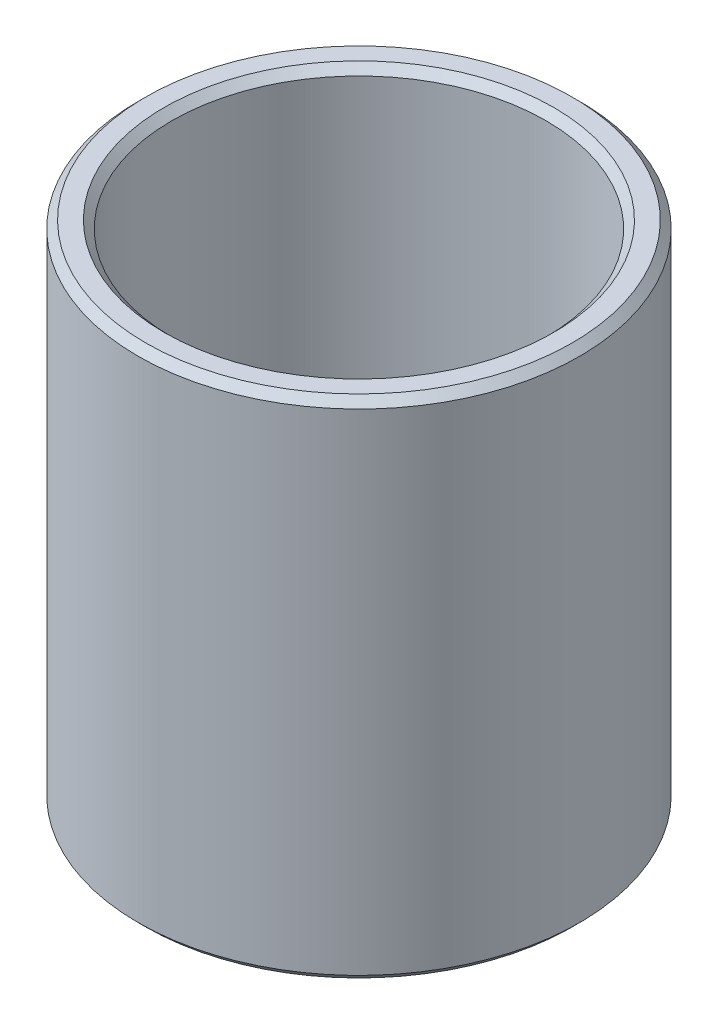
ISO-10303-21;
HEADER;
FILE_DESCRIPTION(('STEP AP214'),'2;1');
FILE_NAME('part.step','',(''),(''),'','','');
FILE_SCHEMA(('AUTOMOTIVE_DESIGN { 1 0 10303 214 1 1 1 1 }'));
ENDSEC;
DATA;
#1=APPLICATION_CONTEXT('core data for automotive mechanical design processes');
#2=APPLICATION_PROTOCOL_DEFINITION('international standard','automotive_design',2000,#1);
#3=PRODUCT_CONTEXT('',#1,'mechanical');
#4=PRODUCT('Part','Part','',(#3));
#5=PRODUCT_RELATED_PRODUCT_CATEGORY('part','',(#4));
#6=PRODUCT_DEFINITION_FORMATION('','',#4);
#7=PRODUCT_DEFINITION_CONTEXT('part definition',#1,'design');
#8=PRODUCT_DEFINITION('design','',#6,#7);
#9=PRODUCT_DEFINITION_SHAPE('','',#8);
#10=(LENGTH_UNIT() NAMED_UNIT(*) SI_UNIT(.MILLI.,.METRE.));
#11=(NAMED_UNIT(*) PLANE_ANGLE_UNIT() SI_UNIT($,.RADIAN.));
#12=(NAMED_UNIT(*) SI_UNIT($,.STERADIAN.) SOLID_ANGLE_UNIT());
#13=UNCERTAINTY_MEASURE_WITH_UNIT(LENGTH_MEASURE(1.E-05),#10,'distance_accuracy_value','');
#14=(GEOMETRIC_REPRESENTATION_CONTEXT(3) GLOBAL_UNCERTAINTY_ASSIGNED_CONTEXT((#13)) GLOBAL_UNIT_ASSIGNED_CONTEXT((#10,
#11,#12)) REPRESENTATION_CONTEXT('',''));
#15=CARTESIAN_POINT('',(0.,0.,0.));
#16=DIRECTION('',(0.,0.,1.));
#17=DIRECTION('',(1.,0.,0.));
#18=AXIS2_PLACEMENT_3D('',#15,#16,#17);
#19=CARTESIAN_POINT('',(0.,45.8151891496123,0.));
#20=DIRECTION('',(0.,-1.,0.));
#21=DIRECTION('',(0.,0.,-1.));
#22=AXIS2_PLACEMENT_3D('',#19,#20,#21);
#23=CYLINDRICAL_SURFACE('',#22,20.);
#24=CARTESIAN_POINT('',(0.,0.694029961642674,0.));
#25=DIRECTION('',(0.,1.,0.));
#26=DIRECTION('',(0.,0.,1.));
#27=AXIS2_PLACEMENT_3D('',#24,#25,#26);
#28=CIRCLE('',#27,20.);
#29=CARTESIAN_POINT('',(0.,0.694029961642674,20.));
#30=VERTEX_POINT('',#29);
#31=EDGE_CURVE('E10',#30,#30,#28,.T.);
#32=ORIENTED_EDGE('',*,*,#31,.T.);
#33=EDGE_LOOP('',(#32));
#34=FACE_BOUND('',#33,.T.);
#35=CARTESIAN_POINT('',(0.,45.1211591879696,0.));
#36=DIRECTION('',(0.,1.,0.));
#37=DIRECTION('',(0.,0.,1.));
#38=AXIS2_PLACEMENT_3D('',#35,#36,#37);
#39=CIRCLE('',#38,20.);
#40=CARTESIAN_POINT('',(0.,45.1211591879696,20.));
#41=VERTEX_POINT('',#40);
#42=EDGE_CURVE('E50',#41,#41,#39,.F.);
#43=ORIENTED_EDGE('',*,*,#42,.T.);
#44=EDGE_LOOP('',(#43));
#45=FACE_BOUND('',#44,.T.);
#46=ADVANCED_FACE('F39',(#34,#45),#23,.T.);
#47=CARTESIAN_POINT('',(0.,45.8151891496123,0.));
#48=DIRECTION('',(0.,1.,0.));
#49=DIRECTION('',(0.,0.,1.));
#50=AXIS2_PLACEMENT_3D('',#47,#48,#49);
#51=PLANE('',#50);
#52=CARTESIAN_POINT('',(0.,45.8151891496123,0.));
#53=DIRECTION('',(0.,1.,0.));
#54=DIRECTION('',(0.,0.,1.));
#55=AXIS2_PLACEMENT_3D('',#52,#53,#54);
#56=CIRCLE('',#55,17.6491751661337);
#57=CARTESIAN_POINT('',(0.,45.8151891496123,17.6491751661337));
#58=VERTEX_POINT('',#57);
#59=EDGE_CURVE('E58',#58,#58,#56,.F.);
#60=ORIENTED_EDGE('',*,*,#59,.T.);
#61=EDGE_LOOP('',(#60));
#62=FACE_BOUND('',#61,.T.);
#63=CARTESIAN_POINT('',(0.,45.8151891496123,0.));
#64=DIRECTION('',(0.,1.,0.));
#65=DIRECTION('',(0.,0.,1.));
#66=AXIS2_PLACEMENT_3D('',#63,#64,#65);
#67=CIRCLE('',#66,19.3059700383573);
#68=CARTESIAN_POINT('',(0.,45.8151891496123,19.3059700383573));
#69=VERTEX_POINT('',#68);
#70=EDGE_CURVE('E61',#69,#69,#67,.T.);
#71=ORIENTED_EDGE('',*,*,#70,.T.);
#72=EDGE_LOOP('',(#71));
#73=FACE_BOUND('',#72,.T.);
#74=ADVANCED_FACE('F88',(#62,#73),#51,.T.);
#75=CARTESIAN_POINT('',(0.,0.,0.));
#76=DIRECTION('',(0.,1.,0.));
#77=DIRECTION('',(0.,0.,1.));
#78=AXIS2_PLACEMENT_3D('',#75,#76,#77);
#79=PLANE('',#78);
#80=CARTESIAN_POINT('',(0.,0.,0.));
#81=DIRECTION('',(0.,1.,0.));
#82=DIRECTION('',(0.,0.,1.));
#83=AXIS2_PLACEMENT_3D('',#80,#81,#82);
#84=CIRCLE('',#83,17.6491751661337);
#85=CARTESIAN_POINT('',(0.,0.,17.6491751661337));
#86=VERTEX_POINT('',#85);
#87=EDGE_CURVE('E51',#86,#86,#84,.T.);
#88=ORIENTED_EDGE('',*,*,#87,.T.);
#89=EDGE_LOOP('',(#88));
#90=FACE_BOUND('',#89,.T.);
#91=CARTESIAN_POINT('',(0.,0.,0.));
#92=DIRECTION('',(0.,1.,0.));
#93=DIRECTION('',(0.,0.,1.));
#94=AXIS2_PLACEMENT_3D('',#91,#92,#93);
#95=CIRCLE('',#94,19.3059700383573);
#96=CARTESIAN_POINT('',(0.,0.,19.3059700383573));
#97=VERTEX_POINT('',#96);
#98=EDGE_CURVE('E54',#97,#97,#95,.F.);
#99=ORIENTED_EDGE('',*,*,#98,.T.);
#100=EDGE_LOOP('',(#99));
#101=FACE_BOUND('',#100,.T.);
#102=ADVANCED_FACE('F83',(#90,#101),#79,.F.);
#103=CARTESIAN_POINT('',(0.,45.8151891496123,0.));
#104=DIRECTION('',(0.,-1.,0.));
#105=DIRECTION('',(0.,0.,-1.));
#106=AXIS2_PLACEMENT_3D('',#103,#104,#105);
#107=CYLINDRICAL_SURFACE('',#106,16.955145204491);
#108=CARTESIAN_POINT('',(0.,45.1211591879697,0.));
#109=DIRECTION('',(0.,1.,0.));
#110=DIRECTION('',(0.,0.,1.));
#111=AXIS2_PLACEMENT_3D('',#108,#109,#110);
#112=CIRCLE('',#111,16.955145204491);
#113=CARTESIAN_POINT('',(0.,45.1211591879697,16.955145204491));
#114=VERTEX_POINT('',#113);
#115=EDGE_CURVE('E67',#114,#114,#112,.T.);
#116=ORIENTED_EDGE('',*,*,#115,.T.);
#117=EDGE_LOOP('',(#116));
#118=FACE_BOUND('',#117,.T.);
#119=CARTESIAN_POINT('',(0.,0.694029961642688,0.));
#120=DIRECTION('',(0.,1.,0.));
#121=DIRECTION('',(0.,0.,1.));
#122=AXIS2_PLACEMENT_3D('',#119,#120,#121);
#123=CIRCLE('',#122,16.955145204491);
#124=CARTESIAN_POINT('',(0.,0.694029961642688,16.955145204491));
#125=VERTEX_POINT('',#124);
#126=EDGE_CURVE('E69',#125,#125,#123,.F.);
#127=ORIENTED_EDGE('',*,*,#126,.T.);
#128=EDGE_LOOP('',(#127));
#129=FACE_BOUND('',#128,.T.);
#130=ADVANCED_FACE('F71',(#118,#129),#107,.F.);
#131=CARTESIAN_POINT('',(0.,45.1211591879697,0.));
#132=DIRECTION('',(0.,1.,0.));
#133=DIRECTION('',(0.,0.,1.));
#134=AXIS2_PLACEMENT_3D('',#131,#132,#133);
#135=CONICAL_SURFACE('',#134,16.955145204491,0.785398163397448);
#136=ORIENTED_EDGE('',*,*,#59,.F.);
#137=EDGE_LOOP('',(#136));
#138=FACE_BOUND('',#137,.T.);
#139=ORIENTED_EDGE('',*,*,#115,.F.);
#140=EDGE_LOOP('',(#139));
#141=FACE_BOUND('',#140,.T.);
#142=ADVANCED_FACE('F77',(#138,#141),#135,.F.);
#143=CARTESIAN_POINT('',(0.,0.,0.));
#144=DIRECTION('',(0.,-1.,0.));
#145=DIRECTION('',(0.,0.,-1.));
#146=AXIS2_PLACEMENT_3D('',#143,#144,#145);
#147=CONICAL_SURFACE('',#146,17.6491751661337,0.785398163397438);
#148=ORIENTED_EDGE('',*,*,#126,.F.);
#149=EDGE_LOOP('',(#148));
#150=FACE_BOUND('',#149,.T.);
#151=ORIENTED_EDGE('',*,*,#87,.F.);
#152=EDGE_LOOP('',(#151));
#153=FACE_BOUND('',#152,.T.);
#154=ADVANCED_FACE('F73',(#150,#153),#147,.F.);
#155=CARTESIAN_POINT('',(0.,0.694029961642674,0.));
#156=DIRECTION('',(0.,1.,0.));
#157=DIRECTION('',(0.,0.,1.));
#158=AXIS2_PLACEMENT_3D('',#155,#156,#157);
#159=CONICAL_SURFACE('',#158,20.,0.785398163397451);
#160=ORIENTED_EDGE('',*,*,#98,.F.);
#161=EDGE_LOOP('',(#160));
#162=FACE_BOUND('',#161,.T.);
#163=ORIENTED_EDGE('',*,*,#31,.F.);
#164=EDGE_LOOP('',(#163));
#165=FACE_BOUND('',#164,.T.);
#166=ADVANCED_FACE('F76',(#162,#165),#159,.T.);
#167=CARTESIAN_POINT('',(0.,45.8151891496123,0.));
#168=DIRECTION('',(0.,-1.,0.));
#169=DIRECTION('',(0.,0.,-1.));
#170=AXIS2_PLACEMENT_3D('',#167,#168,#169);
#171=CONICAL_SURFACE('',#170,19.3059700383573,0.785398163397436);
#172=ORIENTED_EDGE('',*,*,#42,.F.);
#173=EDGE_LOOP('',(#172));
#174=FACE_BOUND('',#173,.T.);
#175=ORIENTED_EDGE('',*,*,#70,.F.);
#176=EDGE_LOOP('',(#175));
#177=FACE_BOUND('',#176,.T.);
#178=ADVANCED_FACE('F45',(#174,#177),#171,.T.);
#179=CLOSED_SHELL('',(#46,#74,#102,#130,#142,#154,#166,#178));
#180=MANIFOLD_SOLID_BREP('B2',#179);
#181=ADVANCED_BREP_SHAPE_REPRESENTATION('',(#18,#180),#14);
#182=SHAPE_DEFINITION_REPRESENTATION(#9,#181);
ENDSEC;
END-ISO-10303-21;
